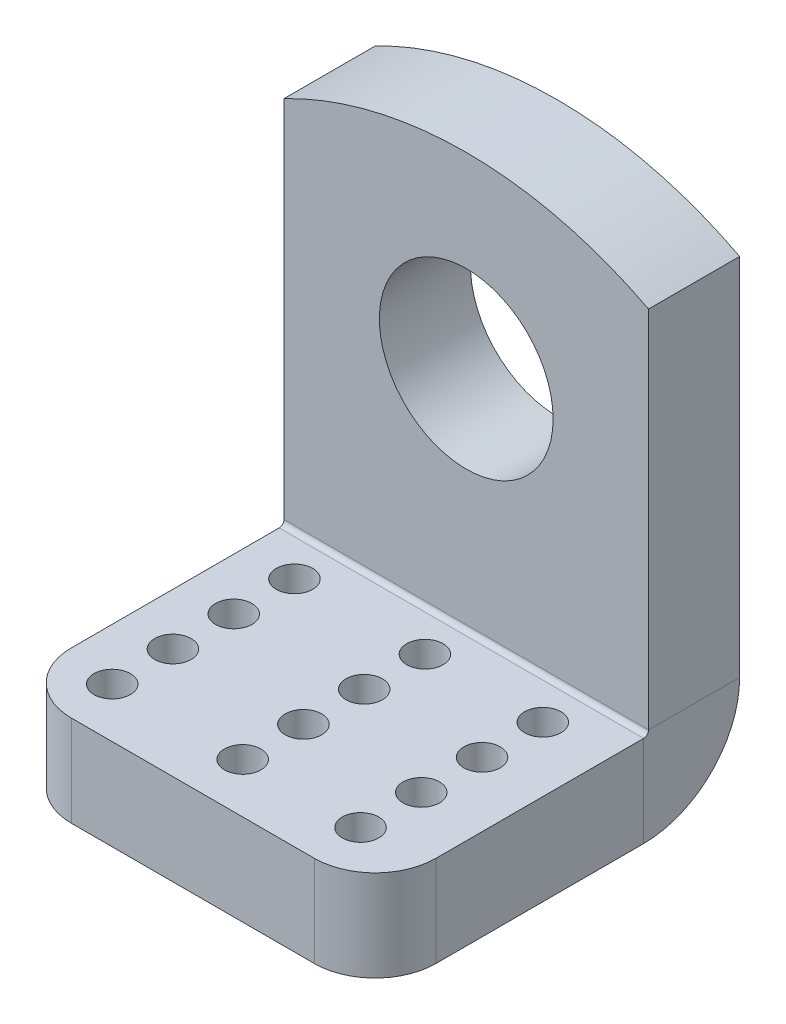
ISO-10303-21;
HEADER;
FILE_DESCRIPTION(('STEP AP214'),'2;1');
FILE_NAME('part.step','',(''),(''),'','','');
FILE_SCHEMA(('AUTOMOTIVE_DESIGN { 1 0 10303 214 1 1 1 1 }'));
ENDSEC;
DATA;
#1=APPLICATION_CONTEXT('core data for automotive mechanical design processes');
#2=APPLICATION_PROTOCOL_DEFINITION('international standard','automotive_design',2000,#1);
#3=PRODUCT_CONTEXT('',#1,'mechanical');
#4=PRODUCT('Part','Part','',(#3));
#5=PRODUCT_RELATED_PRODUCT_CATEGORY('part','',(#4));
#6=PRODUCT_DEFINITION_FORMATION('','',#4);
#7=PRODUCT_DEFINITION_CONTEXT('part definition',#1,'design');
#8=PRODUCT_DEFINITION('design','',#6,#7);
#9=PRODUCT_DEFINITION_SHAPE('','',#8);
#10=(LENGTH_UNIT() NAMED_UNIT(*) SI_UNIT(.MILLI.,.METRE.));
#11=(NAMED_UNIT(*) PLANE_ANGLE_UNIT() SI_UNIT($,.RADIAN.));
#12=(NAMED_UNIT(*) SI_UNIT($,.STERADIAN.) SOLID_ANGLE_UNIT());
#13=UNCERTAINTY_MEASURE_WITH_UNIT(LENGTH_MEASURE(1.E-05),#10,'distance_accuracy_value','');
#14=(GEOMETRIC_REPRESENTATION_CONTEXT(3) GLOBAL_UNCERTAINTY_ASSIGNED_CONTEXT((#13)) GLOBAL_UNIT_ASSIGNED_CONTEXT((#10,
#11,#12)) REPRESENTATION_CONTEXT('',''));
#15=CARTESIAN_POINT('',(0.,0.,0.));
#16=DIRECTION('',(0.,0.,1.));
#17=DIRECTION('',(1.,0.,0.));
#18=AXIS2_PLACEMENT_3D('',#15,#16,#17);
#19=CARTESIAN_POINT('',(-30.,0.,-15.));
#20=DIRECTION('',(-1.,0.,0.));
#21=DIRECTION('',(0.,0.,1.));
#22=AXIS2_PLACEMENT_3D('',#19,#20,#21);
#23=PLANE('',#22);
#24=DIRECTION('',(0.,-1.,0.));
#25=VECTOR('',#24,1.);
#26=CARTESIAN_POINT('',(-30.,0.,0.));
#27=LINE('',#26,#25);
#28=CARTESIAN_POINT('',(-30.,60.,0.));
#29=VERTEX_POINT('',#28);
#30=CARTESIAN_POINT('',(-30.,0.,0.));
#31=VERTEX_POINT('',#30);
#32=EDGE_CURVE('E194',#29,#31,#27,.T.);
#33=ORIENTED_EDGE('',*,*,#32,.F.);
#34=DIRECTION('',(0.,0.,1.));
#35=VECTOR('',#34,1.);
#36=CARTESIAN_POINT('',(-30.,60.,-15.));
#37=LINE('',#36,#35);
#38=CARTESIAN_POINT('',(-30.,60.,-15.));
#39=VERTEX_POINT('',#38);
#40=EDGE_CURVE('E219',#39,#29,#37,.T.);
#41=ORIENTED_EDGE('',*,*,#40,.F.);
#42=DIRECTION('',(0.,-1.,0.));
#43=VECTOR('',#42,1.);
#44=CARTESIAN_POINT('',(-30.,0.,-15.));
#45=LINE('',#44,#43);
#46=CARTESIAN_POINT('',(-30.,0.,-15.));
#47=VERTEX_POINT('',#46);
#48=EDGE_CURVE('E197',#39,#47,#45,.T.);
#49=ORIENTED_EDGE('',*,*,#48,.T.);
#50=DIRECTION('',(0.,0.,1.));
#51=VECTOR('',#50,1.);
#52=CARTESIAN_POINT('',(-30.,0.,-15.));
#53=LINE('',#52,#51);
#54=EDGE_CURVE('E208',#47,#31,#53,.T.);
#55=ORIENTED_EDGE('',*,*,#54,.T.);
#56=EDGE_LOOP('',(#33,#41,#49,#55));
#57=FACE_BOUND('',#56,.T.);
#58=ADVANCED_FACE('F59',(#57),#23,.T.);
#59=CARTESIAN_POINT('',(0.,2.33718702664602,-15.));
#60=DIRECTION('',(0.,0.,1.));
#61=DIRECTION('',(1.,0.,0.));
#62=AXIS2_PLACEMENT_3D('',#59,#60,#61);
#63=CYLINDRICAL_SURFACE('',#62,65.);
#64=CARTESIAN_POINT('',(0.,2.33718702664602,0.));
#65=DIRECTION('',(0.,0.,1.));
#66=DIRECTION('',(-1.,0.,0.));
#67=AXIS2_PLACEMENT_3D('',#64,#65,#66);
#68=CIRCLE('',#67,65.);
#69=CARTESIAN_POINT('',(30.,60.,0.));
#70=VERTEX_POINT('',#69);
#71=EDGE_CURVE('E200',#70,#29,#68,.T.);
#72=ORIENTED_EDGE('',*,*,#71,.F.);
#73=DIRECTION('',(0.,0.,1.));
#74=VECTOR('',#73,1.);
#75=CARTESIAN_POINT('',(30.,60.,-15.));
#76=LINE('',#75,#74);
#77=CARTESIAN_POINT('',(30.,60.,-15.));
#78=VERTEX_POINT('',#77);
#79=EDGE_CURVE('E222',#78,#70,#76,.T.);
#80=ORIENTED_EDGE('',*,*,#79,.F.);
#81=CARTESIAN_POINT('',(0.,2.33718702664602,-15.));
#82=DIRECTION('',(0.,0.,1.));
#83=DIRECTION('',(-1.,0.,0.));
#84=AXIS2_PLACEMENT_3D('',#81,#82,#83);
#85=CIRCLE('',#84,65.);
#86=EDGE_CURVE('E205',#78,#39,#85,.T.);
#87=ORIENTED_EDGE('',*,*,#86,.T.);
#88=ORIENTED_EDGE('',*,*,#40,.T.);
#89=EDGE_LOOP('',(#72,#80,#87,#88));
#90=FACE_BOUND('',#89,.T.);
#91=ADVANCED_FACE('F267',(#90),#63,.T.);
#92=CARTESIAN_POINT('',(30.,0.,-15.));
#93=DIRECTION('',(1.,0.,0.));
#94=DIRECTION('',(0.,0.,-1.));
#95=AXIS2_PLACEMENT_3D('',#92,#93,#94);
#96=PLANE('',#95);
#97=DIRECTION('',(0.,1.,0.));
#98=VECTOR('',#97,1.);
#99=CARTESIAN_POINT('',(30.,0.,0.));
#100=LINE('',#99,#98);
#101=CARTESIAN_POINT('',(30.,0.,0.));
#102=VERTEX_POINT('',#101);
#103=EDGE_CURVE('E214',#102,#70,#100,.T.);
#104=ORIENTED_EDGE('',*,*,#103,.F.);
#105=DIRECTION('',(0.,0.,1.));
#106=VECTOR('',#105,1.);
#107=CARTESIAN_POINT('',(30.,0.,-15.));
#108=LINE('',#107,#106);
#109=CARTESIAN_POINT('',(30.,0.,-15.));
#110=VERTEX_POINT('',#109);
#111=EDGE_CURVE('E224',#110,#102,#108,.T.);
#112=ORIENTED_EDGE('',*,*,#111,.F.);
#113=DIRECTION('',(0.,1.,0.));
#114=VECTOR('',#113,1.);
#115=CARTESIAN_POINT('',(30.,0.,-15.));
#116=LINE('',#115,#114);
#117=EDGE_CURVE('E202',#110,#78,#116,.T.);
#118=ORIENTED_EDGE('',*,*,#117,.T.);
#119=ORIENTED_EDGE('',*,*,#79,.T.);
#120=EDGE_LOOP('',(#104,#112,#118,#119));
#121=FACE_BOUND('',#120,.T.);
#122=ADVANCED_FACE('F273',(#121),#96,.T.);
#123=CARTESIAN_POINT('',(0.,2.33718702664602,-15.));
#124=DIRECTION('',(0.,0.,-1.));
#125=DIRECTION('',(-1.,0.,0.));
#126=AXIS2_PLACEMENT_3D('',#123,#124,#125);
#127=PLANE('',#126);
#128=CARTESIAN_POINT('',(0.,36.48,-15.));
#129=DIRECTION('',(0.,0.,1.));
#130=DIRECTION('',(1.,0.,0.));
#131=AXIS2_PLACEMENT_3D('',#128,#129,#130);
#132=CIRCLE('',#131,14.3);
#133=CARTESIAN_POINT('',(14.3,36.48,-15.));
#134=VERTEX_POINT('',#133);
#135=EDGE_CURVE('E191',#134,#134,#132,.T.);
#136=ORIENTED_EDGE('',*,*,#135,.T.);
#137=EDGE_LOOP('',(#136));
#138=FACE_BOUND('',#137,.T.);
#139=ORIENTED_EDGE('',*,*,#48,.F.);
#140=ORIENTED_EDGE('',*,*,#86,.F.);
#141=ORIENTED_EDGE('',*,*,#117,.F.);
#142=DIRECTION('',(1.,0.,0.));
#143=VECTOR('',#142,1.);
#144=CARTESIAN_POINT('',(-30.,0.,-15.));
#145=LINE('',#144,#143);
#146=EDGE_CURVE('E147',#47,#110,#145,.T.);
#147=ORIENTED_EDGE('',*,*,#146,.F.);
#148=EDGE_LOOP('',(#139,#140,#141,#147));
#149=FACE_BOUND('',#148,.T.);
#150=ADVANCED_FACE('F270',(#138,#149),#127,.T.);
#151=CARTESIAN_POINT('',(0.,2.33718702664602,0.));
#152=DIRECTION('',(0.,0.,-1.));
#153=DIRECTION('',(-1.,0.,0.));
#154=AXIS2_PLACEMENT_3D('',#151,#152,#153);
#155=PLANE('',#154);
#156=CARTESIAN_POINT('',(0.,36.48,0.));
#157=DIRECTION('',(0.,0.,1.));
#158=DIRECTION('',(1.,0.,0.));
#159=AXIS2_PLACEMENT_3D('',#156,#157,#158);
#160=CIRCLE('',#159,14.3);
#161=CARTESIAN_POINT('',(14.3,36.48,0.));
#162=VERTEX_POINT('',#161);
#163=EDGE_CURVE('E186',#162,#162,#160,.T.);
#164=ORIENTED_EDGE('',*,*,#163,.F.);
#165=EDGE_LOOP('',(#164));
#166=FACE_BOUND('',#165,.T.);
#167=ORIENTED_EDGE('',*,*,#32,.T.);
#168=DIRECTION('',(1.,0.,0.));
#169=VECTOR('',#168,1.);
#170=CARTESIAN_POINT('',(-30.,0.,0.));
#171=LINE('',#170,#169);
#172=EDGE_CURVE('E211',#31,#102,#171,.T.);
#173=ORIENTED_EDGE('',*,*,#172,.T.);
#174=ORIENTED_EDGE('',*,*,#103,.T.);
#175=ORIENTED_EDGE('',*,*,#71,.T.);
#176=EDGE_LOOP('',(#167,#173,#174,#175));
#177=FACE_BOUND('',#176,.T.);
#178=ADVANCED_FACE('F264',(#166,#177),#155,.F.);
#179=CARTESIAN_POINT('',(0.,36.48,-15.));
#180=DIRECTION('',(0.,0.,1.));
#181=DIRECTION('',(1.,0.,0.));
#182=AXIS2_PLACEMENT_3D('',#179,#180,#181);
#183=CYLINDRICAL_SURFACE('',#182,14.3);
#184=ORIENTED_EDGE('',*,*,#135,.F.);
#185=EDGE_LOOP('',(#184));
#186=FACE_BOUND('',#185,.T.);
#187=ORIENTED_EDGE('',*,*,#163,.T.);
#188=EDGE_LOOP('',(#187));
#189=FACE_BOUND('',#188,.T.);
#190=ADVANCED_FACE('F348',(#186,#189),#183,.F.);
#191=CARTESIAN_POINT('',(-30.,0.,0.8));
#192=DIRECTION('',(-1.,0.,0.));
#193=DIRECTION('',(0.,-1.,0.));
#194=AXIS2_PLACEMENT_3D('',#191,#192,#193);
#195=PLANE('',#194);
#196=DIRECTION('',(0.,1.,0.));
#197=VECTOR('',#196,1.);
#198=CARTESIAN_POINT('',(-30.,-15.8,0.799999999999945));
#199=LINE('',#198,#197);
#200=CARTESIAN_POINT('',(-30.,-0.8,0.799999999999997));
#201=VERTEX_POINT('',#200);
#202=CARTESIAN_POINT('',(-30.,-15.8,0.799999999999944));
#203=VERTEX_POINT('',#202);
#204=EDGE_CURVE('E182',#201,#203,#199,.F.);
#205=ORIENTED_EDGE('',*,*,#204,.F.);
#206=CARTESIAN_POINT('',(-30.,0.,0.8));
#207=DIRECTION('',(1.,0.,0.));
#208=DIRECTION('',(0.,1.,0.));
#209=AXIS2_PLACEMENT_3D('',#206,#207,#208);
#210=CIRCLE('',#209,0.799999999999998);
#211=EDGE_CURVE('E151',#31,#201,#210,.F.);
#212=ORIENTED_EDGE('',*,*,#211,.F.);
#213=ORIENTED_EDGE('',*,*,#54,.F.);
#214=CARTESIAN_POINT('',(-30.,0.,0.8));
#215=DIRECTION('',(1.,0.,0.));
#216=DIRECTION('',(0.,1.,0.));
#217=AXIS2_PLACEMENT_3D('',#214,#215,#216);
#218=CIRCLE('',#217,15.8);
#219=EDGE_CURVE('E150',#47,#203,#218,.F.);
#220=ORIENTED_EDGE('',*,*,#219,.T.);
#221=EDGE_LOOP('',(#205,#212,#213,#220));
#222=FACE_BOUND('',#221,.T.);
#223=ADVANCED_FACE('F259',(#222),#195,.T.);
#224=CARTESIAN_POINT('',(30.,0.,0.8));
#225=DIRECTION('',(-1.,0.,0.));
#226=DIRECTION('',(0.,-1.,0.));
#227=AXIS2_PLACEMENT_3D('',#224,#225,#226);
#228=PLANE('',#227);
#229=CARTESIAN_POINT('',(30.,0.,0.8));
#230=DIRECTION('',(1.,0.,0.));
#231=DIRECTION('',(0.,1.,0.));
#232=AXIS2_PLACEMENT_3D('',#229,#230,#231);
#233=CIRCLE('',#232,0.799999999999998);
#234=CARTESIAN_POINT('',(30.,-0.799999999999996,0.799999999999997));
#235=VERTEX_POINT('',#234);
#236=EDGE_CURVE('E158',#235,#102,#233,.T.);
#237=ORIENTED_EDGE('',*,*,#236,.F.);
#238=DIRECTION('',(0.,1.,0.));
#239=VECTOR('',#238,1.);
#240=CARTESIAN_POINT('',(30.,-0.8,0.799999999999997));
#241=LINE('',#240,#239);
#242=CARTESIAN_POINT('',(30.,-15.8,0.799999999999945));
#243=VERTEX_POINT('',#242);
#244=EDGE_CURVE('E155',#235,#243,#241,.F.);
#245=ORIENTED_EDGE('',*,*,#244,.T.);
#246=CARTESIAN_POINT('',(30.,0.,0.8));
#247=DIRECTION('',(1.,0.,0.));
#248=DIRECTION('',(0.,1.,0.));
#249=AXIS2_PLACEMENT_3D('',#246,#247,#248);
#250=CIRCLE('',#249,15.8);
#251=EDGE_CURVE('E140',#243,#110,#250,.T.);
#252=ORIENTED_EDGE('',*,*,#251,.T.);
#253=ORIENTED_EDGE('',*,*,#111,.T.);
#254=EDGE_LOOP('',(#237,#245,#252,#253));
#255=FACE_BOUND('',#254,.T.);
#256=ADVANCED_FACE('F156',(#255),#228,.F.);
#257=CARTESIAN_POINT('',(30.,0.,0.8));
#258=DIRECTION('',(1.,0.,0.));
#259=DIRECTION('',(0.,-1.,0.));
#260=AXIS2_PLACEMENT_3D('',#257,#258,#259);
#261=CYLINDRICAL_SURFACE('',#260,15.8);
#262=ORIENTED_EDGE('',*,*,#146,.T.);
#263=ORIENTED_EDGE('',*,*,#251,.F.);
#264=DIRECTION('',(1.,0.,0.));
#265=VECTOR('',#264,1.);
#266=CARTESIAN_POINT('',(-30.,-15.8,0.799999999999945));
#267=LINE('',#266,#265);
#268=EDGE_CURVE('E145',#243,#203,#267,.F.);
#269=ORIENTED_EDGE('',*,*,#268,.T.);
#270=ORIENTED_EDGE('',*,*,#219,.F.);
#271=EDGE_LOOP('',(#262,#263,#269,#270));
#272=FACE_BOUND('',#271,.T.);
#273=ADVANCED_FACE('F142',(#272),#261,.T.);
#274=CARTESIAN_POINT('',(30.,0.,0.8));
#275=DIRECTION('',(1.,0.,0.));
#276=DIRECTION('',(0.,-1.,0.));
#277=AXIS2_PLACEMENT_3D('',#274,#275,#276);
#278=CYLINDRICAL_SURFACE('',#277,0.799999999999998);
#279=ORIENTED_EDGE('',*,*,#172,.F.);
#280=ORIENTED_EDGE('',*,*,#211,.T.);
#281=DIRECTION('',(1.,0.,0.));
#282=VECTOR('',#281,1.);
#283=CARTESIAN_POINT('',(-30.,-0.8,0.799999999999997));
#284=LINE('',#283,#282);
#285=EDGE_CURVE('E160',#201,#235,#284,.T.);
#286=ORIENTED_EDGE('',*,*,#285,.T.);
#287=ORIENTED_EDGE('',*,*,#236,.T.);
#288=EDGE_LOOP('',(#279,#280,#286,#287));
#289=FACE_BOUND('',#288,.T.);
#290=ADVANCED_FACE('F255',(#289),#278,.F.);
#291=CARTESIAN_POINT('',(-30.,-15.8,0.));
#292=DIRECTION('',(1.,0.,0.));
#293=DIRECTION('',(0.,0.,-1.));
#294=AXIS2_PLACEMENT_3D('',#291,#292,#293);
#295=PLANE('',#294);
#296=DIRECTION('',(0.,0.,-1.));
#297=VECTOR('',#296,1.);
#298=CARTESIAN_POINT('',(-30.,-15.8,0.));
#299=LINE('',#298,#297);
#300=CARTESIAN_POINT('',(-30.,-15.8000000000001,35.));
#301=VERTEX_POINT('',#300);
#302=EDGE_CURVE('E165',#301,#203,#299,.T.);
#303=ORIENTED_EDGE('',*,*,#302,.F.);
#304=DIRECTION('',(0.,1.,0.));
#305=VECTOR('',#304,1.);
#306=CARTESIAN_POINT('',(-30.,-15.8000000000001,35.));
#307=LINE('',#306,#305);
#308=CARTESIAN_POINT('',(-30.,-0.800000000000119,35.0000000000001));
#309=VERTEX_POINT('',#308);
#310=EDGE_CURVE('E13',#301,#309,#307,.T.);
#311=ORIENTED_EDGE('',*,*,#310,.T.);
#312=DIRECTION('',(0.,0.,1.));
#313=VECTOR('',#312,1.);
#314=CARTESIAN_POINT('',(-30.,-0.799999999999997,0.));
#315=LINE('',#314,#313);
#316=EDGE_CURVE('E166',#309,#201,#315,.F.);
#317=ORIENTED_EDGE('',*,*,#316,.T.);
#318=ORIENTED_EDGE('',*,*,#204,.T.);
#319=EDGE_LOOP('',(#303,#311,#317,#318));
#320=FACE_BOUND('',#319,.T.);
#321=ADVANCED_FACE('F251',(#320),#295,.F.);
#322=CARTESIAN_POINT('',(30.,-15.8000000000002,45.));
#323=DIRECTION('',(-1.,0.,0.));
#324=DIRECTION('',(0.,0.,1.));
#325=AXIS2_PLACEMENT_3D('',#322,#323,#324);
#326=PLANE('',#325);
#327=DIRECTION('',(0.,0.,-1.));
#328=VECTOR('',#327,1.);
#329=CARTESIAN_POINT('',(30.,-0.800000000000155,45.0000000000001));
#330=LINE('',#329,#328);
#331=CARTESIAN_POINT('',(30.,-0.80000000000012,35.0000000000001));
#332=VERTEX_POINT('',#331);
#333=EDGE_CURVE('E178',#235,#332,#330,.F.);
#334=ORIENTED_EDGE('',*,*,#333,.T.);
#335=DIRECTION('',(0.,1.,0.));
#336=VECTOR('',#335,1.);
#337=CARTESIAN_POINT('',(30.,-15.8000000000001,35.));
#338=LINE('',#337,#336);
#339=CARTESIAN_POINT('',(30.,-15.8000000000001,35.));
#340=VERTEX_POINT('',#339);
#341=EDGE_CURVE('E82',#332,#340,#338,.F.);
#342=ORIENTED_EDGE('',*,*,#341,.T.);
#343=DIRECTION('',(0.,0.,1.));
#344=VECTOR('',#343,1.);
#345=CARTESIAN_POINT('',(30.,-15.8,0.));
#346=LINE('',#345,#344);
#347=EDGE_CURVE('E163',#243,#340,#346,.T.);
#348=ORIENTED_EDGE('',*,*,#347,.F.);
#349=ORIENTED_EDGE('',*,*,#244,.F.);
#350=EDGE_LOOP('',(#334,#342,#348,#349));
#351=FACE_BOUND('',#350,.T.);
#352=ADVANCED_FACE('F168',(#351),#326,.F.);
#353=CARTESIAN_POINT('',(0.,-15.8,0.));
#354=DIRECTION('',(0.,1.,0.));
#355=DIRECTION('',(0.,0.,1.));
#356=AXIS2_PLACEMENT_3D('',#353,#354,#355);
#357=PLANE('',#356);
#358=CARTESIAN_POINT('',(-21.4780939505529,-15.8000000000001,36.8007276352638));
#359=DIRECTION('',(0.,1.,0.));
#360=DIRECTION('',(0.,0.,1.));
#361=AXIS2_PLACEMENT_3D('',#358,#359,#360);
#362=CIRCLE('',#361,3.);
#363=CARTESIAN_POINT('',(-21.4780939505529,-15.8000000000001,39.8007276352638));
#364=VERTEX_POINT('',#363);
#365=EDGE_CURVE('E185',#364,#364,#362,.T.);
#366=ORIENTED_EDGE('',*,*,#365,.T.);
#367=EDGE_LOOP('',(#366));
#368=FACE_BOUND('',#367,.T.);
#369=CARTESIAN_POINT('',(1.05479317354402E-13,-15.8000000000001,16.8007276352638));
#370=DIRECTION('',(0.,1.,0.));
#371=DIRECTION('',(0.,0.,1.));
#372=AXIS2_PLACEMENT_3D('',#369,#370,#371);
#373=CIRCLE('',#372,3.);
#374=CARTESIAN_POINT('',(1.05479317354402E-13,-15.8000000000001,19.8007276352638));
#375=VERTEX_POINT('',#374);
#376=EDGE_CURVE('E522',#375,#375,#373,.T.);
#377=ORIENTED_EDGE('',*,*,#376,.T.);
#378=EDGE_LOOP('',(#377));
#379=FACE_BOUND('',#378,.T.);
#380=CARTESIAN_POINT('',(2.10223757519696E-13,-15.8000000000001,26.8007276352638));
#381=DIRECTION('',(0.,1.,0.));
#382=DIRECTION('',(0.,0.,1.));
#383=AXIS2_PLACEMENT_3D('',#380,#381,#382);
#384=CIRCLE('',#383,3.);
#385=CARTESIAN_POINT('',(2.10223757519696E-13,-15.8000000000001,29.8007276352638));
#386=VERTEX_POINT('',#385);
#387=EDGE_CURVE('E520',#386,#386,#384,.T.);
#388=ORIENTED_EDGE('',*,*,#387,.T.);
#389=EDGE_LOOP('',(#388));
#390=FACE_BOUND('',#389,.T.);
#391=CARTESIAN_POINT('',(3.1496819768499E-13,-15.8000000000001,36.8007276352638));
#392=DIRECTION('',(0.,1.,0.));
#393=DIRECTION('',(0.,0.,1.));
#394=AXIS2_PLACEMENT_3D('',#391,#392,#393);
#395=CIRCLE('',#394,3.);
#396=CARTESIAN_POINT('',(3.1496819768499E-13,-15.8000000000001,39.8007276352638));
#397=VERTEX_POINT('',#396);
#398=EDGE_CURVE('E523',#397,#397,#395,.T.);
#399=ORIENTED_EDGE('',*,*,#398,.T.);
#400=EDGE_LOOP('',(#399));
#401=FACE_BOUND('',#400,.T.);
#402=CARTESIAN_POINT('',(-21.478093950553,-15.8000000000001,26.8007276352638));
#403=DIRECTION('',(0.,1.,0.));
#404=DIRECTION('',(0.,0.,1.));
#405=AXIS2_PLACEMENT_3D('',#402,#403,#404);
#406=CIRCLE('',#405,3.);
#407=CARTESIAN_POINT('',(-21.478093950553,-15.8000000000001,29.8007276352638));
#408=VERTEX_POINT('',#407);
#409=EDGE_CURVE('E528',#408,#408,#406,.T.);
#410=ORIENTED_EDGE('',*,*,#409,.T.);
#411=EDGE_LOOP('',(#410));
#412=FACE_BOUND('',#411,.T.);
#413=CARTESIAN_POINT('',(-21.4780939505531,-15.8000000000001,16.8007276352638));
#414=DIRECTION('',(0.,1.,0.));
#415=DIRECTION('',(0.,0.,1.));
#416=AXIS2_PLACEMENT_3D('',#413,#414,#415);
#417=CIRCLE('',#416,3.);
#418=CARTESIAN_POINT('',(-21.4780939505531,-15.8000000000001,19.8007276352638));
#419=VERTEX_POINT('',#418);
#420=EDGE_CURVE('E544',#419,#419,#417,.T.);
#421=ORIENTED_EDGE('',*,*,#420,.T.);
#422=EDGE_LOOP('',(#421));
#423=FACE_BOUND('',#422,.T.);
#424=CARTESIAN_POINT('',(0.,-15.8,6.80072763526384));
#425=DIRECTION('',(0.,1.,0.));
#426=DIRECTION('',(0.,0.,1.));
#427=AXIS2_PLACEMENT_3D('',#424,#425,#426);
#428=CIRCLE('',#427,3.);
#429=CARTESIAN_POINT('',(0.,-15.8,9.80072763526384));
#430=VERTEX_POINT('',#429);
#431=EDGE_CURVE('E548',#430,#430,#428,.T.);
#432=ORIENTED_EDGE('',*,*,#431,.T.);
#433=EDGE_LOOP('',(#432));
#434=FACE_BOUND('',#433,.T.);
#435=CARTESIAN_POINT('',(19.3982785214493,-15.8,6.80072763526384));
#436=DIRECTION('',(0.,1.,0.));
#437=DIRECTION('',(0.,0.,1.));
#438=AXIS2_PLACEMENT_3D('',#435,#436,#437);
#439=CIRCLE('',#438,3.);
#440=CARTESIAN_POINT('',(19.3982785214493,-15.8,9.80072763526384));
#441=VERTEX_POINT('',#440);
#442=EDGE_CURVE('E552',#441,#441,#439,.T.);
#443=ORIENTED_EDGE('',*,*,#442,.T.);
#444=EDGE_LOOP('',(#443));
#445=FACE_BOUND('',#444,.T.);
#446=CARTESIAN_POINT('',(19.3982785214494,-15.8000000000001,16.8007276352638));
#447=DIRECTION('',(0.,1.,0.));
#448=DIRECTION('',(0.,0.,1.));
#449=AXIS2_PLACEMENT_3D('',#446,#447,#448);
#450=CIRCLE('',#449,3.);
#451=CARTESIAN_POINT('',(19.3982785214494,-15.8000000000001,19.8007276352638));
#452=VERTEX_POINT('',#451);
#453=EDGE_CURVE('E556',#452,#452,#450,.T.);
#454=ORIENTED_EDGE('',*,*,#453,.T.);
#455=EDGE_LOOP('',(#454));
#456=FACE_BOUND('',#455,.T.);
#457=CARTESIAN_POINT('',(19.3982785214495,-15.8000000000001,26.8007276352638));
#458=DIRECTION('',(0.,1.,0.));
#459=DIRECTION('',(0.,0.,1.));
#460=AXIS2_PLACEMENT_3D('',#457,#458,#459);
#461=CIRCLE('',#460,3.);
#462=CARTESIAN_POINT('',(19.3982785214495,-15.8000000000001,29.8007276352638));
#463=VERTEX_POINT('',#462);
#464=EDGE_CURVE('E560',#463,#463,#461,.T.);
#465=ORIENTED_EDGE('',*,*,#464,.T.);
#466=EDGE_LOOP('',(#465));
#467=FACE_BOUND('',#466,.T.);
#468=CARTESIAN_POINT('',(19.3982785214496,-15.8000000000001,36.8007276352638));
#469=DIRECTION('',(0.,1.,0.));
#470=DIRECTION('',(0.,0.,1.));
#471=AXIS2_PLACEMENT_3D('',#468,#469,#470);
#472=CIRCLE('',#471,3.);
#473=CARTESIAN_POINT('',(19.3982785214496,-15.8000000000001,39.8007276352638));
#474=VERTEX_POINT('',#473);
#475=EDGE_CURVE('E564',#474,#474,#472,.T.);
#476=ORIENTED_EDGE('',*,*,#475,.T.);
#477=EDGE_LOOP('',(#476));
#478=FACE_BOUND('',#477,.T.);
#479=CARTESIAN_POINT('',(-21.4780939505532,-15.8,6.80072763526384));
#480=DIRECTION('',(0.,1.,0.));
#481=DIRECTION('',(0.,0.,1.));
#482=AXIS2_PLACEMENT_3D('',#479,#480,#481);
#483=CIRCLE('',#482,3.);
#484=CARTESIAN_POINT('',(-21.4780939505532,-15.8,9.80072763526384));
#485=VERTEX_POINT('',#484);
#486=EDGE_CURVE('E567',#485,#485,#483,.T.);
#487=ORIENTED_EDGE('',*,*,#486,.T.);
#488=EDGE_LOOP('',(#487));
#489=FACE_BOUND('',#488,.T.);
#490=ORIENTED_EDGE('',*,*,#347,.T.);
#491=CARTESIAN_POINT('',(20.,-15.8000000000001,35.));
#492=DIRECTION('',(0.,1.,0.));
#493=DIRECTION('',(0.,0.,1.));
#494=AXIS2_PLACEMENT_3D('',#491,#492,#493);
#495=CIRCLE('',#494,10.);
#496=CARTESIAN_POINT('',(20.,-15.8000000000002,45.));
#497=VERTEX_POINT('',#496);
#498=EDGE_CURVE('E67',#340,#497,#495,.F.);
#499=ORIENTED_EDGE('',*,*,#498,.T.);
#500=DIRECTION('',(-1.,0.,0.));
#501=VECTOR('',#500,1.);
#502=CARTESIAN_POINT('',(0.,-15.8000000000002,45.));
#503=LINE('',#502,#501);
#504=CARTESIAN_POINT('',(-20.,-15.8000000000002,45.));
#505=VERTEX_POINT('',#504);
#506=EDGE_CURVE('E169',#497,#505,#503,.T.);
#507=ORIENTED_EDGE('',*,*,#506,.T.);
#508=CARTESIAN_POINT('',(-20.,-15.8000000000001,35.));
#509=DIRECTION('',(0.,1.,0.));
#510=DIRECTION('',(0.,0.,1.));
#511=AXIS2_PLACEMENT_3D('',#508,#509,#510);
#512=CIRCLE('',#511,10.);
#513=EDGE_CURVE('E74',#505,#301,#512,.F.);
#514=ORIENTED_EDGE('',*,*,#513,.T.);
#515=ORIENTED_EDGE('',*,*,#302,.T.);
#516=ORIENTED_EDGE('',*,*,#268,.F.);
#517=EDGE_LOOP('',(#490,#499,#507,#514,#515,#516));
#518=FACE_BOUND('',#517,.T.);
#519=ADVANCED_FACE('F162',(#368,#379,#390,#401,#412,#423,#434,#445,#456,#467,#478,#489,#518),
#357,.F.);
#520=CARTESIAN_POINT('',(0.,-0.799999999999997,0.));
#521=DIRECTION('',(0.,1.,0.));
#522=DIRECTION('',(0.,0.,1.));
#523=AXIS2_PLACEMENT_3D('',#520,#521,#522);
#524=PLANE('',#523);
#525=CARTESIAN_POINT('',(-21.4780939505529,-0.800000000000126,36.8007276352639));
#526=DIRECTION('',(0.,1.,0.));
#527=DIRECTION('',(0.,0.,1.));
#528=AXIS2_PLACEMENT_3D('',#525,#526,#527);
#529=CIRCLE('',#528,3.);
#530=CARTESIAN_POINT('',(-21.4780939505529,-0.800000000000136,39.8007276352639));
#531=VERTEX_POINT('',#530);
#532=EDGE_CURVE('E585',#531,#531,#529,.T.);
#533=ORIENTED_EDGE('',*,*,#532,.F.);
#534=EDGE_LOOP('',(#533));
#535=FACE_BOUND('',#534,.T.);
#536=CARTESIAN_POINT('',(1.05479317354402E-13,-0.800000000000056,16.8007276352639));
#537=DIRECTION('',(0.,1.,0.));
#538=DIRECTION('',(0.,0.,1.));
#539=AXIS2_PLACEMENT_3D('',#536,#537,#538);
#540=CIRCLE('',#539,3.);
#541=CARTESIAN_POINT('',(1.05479317354402E-13,-0.800000000000066,19.8007276352639));
#542=VERTEX_POINT('',#541);
#543=EDGE_CURVE('E593',#542,#542,#540,.T.);
#544=ORIENTED_EDGE('',*,*,#543,.F.);
#545=EDGE_LOOP('',(#544));
#546=FACE_BOUND('',#545,.T.);
#547=CARTESIAN_POINT('',(2.10223757519696E-13,-0.800000000000091,26.8007276352639));
#548=DIRECTION('',(0.,1.,0.));
#549=DIRECTION('',(0.,0.,1.));
#550=AXIS2_PLACEMENT_3D('',#547,#548,#549);
#551=CIRCLE('',#550,3.);
#552=CARTESIAN_POINT('',(2.10223757519696E-13,-0.800000000000101,29.8007276352639));
#553=VERTEX_POINT('',#552);
#554=EDGE_CURVE('E517',#553,#553,#551,.T.);
#555=ORIENTED_EDGE('',*,*,#554,.F.);
#556=EDGE_LOOP('',(#555));
#557=FACE_BOUND('',#556,.T.);
#558=CARTESIAN_POINT('',(3.1496819768499E-13,-0.800000000000126,36.8007276352639));
#559=DIRECTION('',(0.,1.,0.));
#560=DIRECTION('',(0.,0.,1.));
#561=AXIS2_PLACEMENT_3D('',#558,#559,#560);
#562=CIRCLE('',#561,3.);
#563=CARTESIAN_POINT('',(3.1496819768499E-13,-0.800000000000136,39.8007276352639));
#564=VERTEX_POINT('',#563);
#565=EDGE_CURVE('E597',#564,#564,#562,.T.);
#566=ORIENTED_EDGE('',*,*,#565,.F.);
#567=EDGE_LOOP('',(#566));
#568=FACE_BOUND('',#567,.T.);
#569=CARTESIAN_POINT('',(-21.478093950553,-0.800000000000091,26.8007276352639));
#570=DIRECTION('',(0.,1.,0.));
#571=DIRECTION('',(0.,0.,1.));
#572=AXIS2_PLACEMENT_3D('',#569,#570,#571);
#573=CIRCLE('',#572,3.);
#574=CARTESIAN_POINT('',(-21.478093950553,-0.800000000000101,29.8007276352639));
#575=VERTEX_POINT('',#574);
#576=EDGE_CURVE('E581',#575,#575,#573,.T.);
#577=ORIENTED_EDGE('',*,*,#576,.F.);
#578=EDGE_LOOP('',(#577));
#579=FACE_BOUND('',#578,.T.);
#580=CARTESIAN_POINT('',(-21.4780939505531,-0.800000000000056,16.8007276352639));
#581=DIRECTION('',(0.,1.,0.));
#582=DIRECTION('',(0.,0.,1.));
#583=AXIS2_PLACEMENT_3D('',#580,#581,#582);
#584=CIRCLE('',#583,3.);
#585=CARTESIAN_POINT('',(-21.4780939505531,-0.800000000000066,19.8007276352639));
#586=VERTEX_POINT('',#585);
#587=EDGE_CURVE('E584',#586,#586,#584,.T.);
#588=ORIENTED_EDGE('',*,*,#587,.F.);
#589=EDGE_LOOP('',(#588));
#590=FACE_BOUND('',#589,.T.);
#591=CARTESIAN_POINT('',(0.,-0.800000000000021,6.8007276352639));
#592=DIRECTION('',(0.,1.,0.));
#593=DIRECTION('',(0.,0.,1.));
#594=AXIS2_PLACEMENT_3D('',#591,#592,#593);
#595=CIRCLE('',#594,3.);
#596=CARTESIAN_POINT('',(0.,-0.800000000000031,9.8007276352639));
#597=VERTEX_POINT('',#596);
#598=EDGE_CURVE('E588',#597,#597,#595,.T.);
#599=ORIENTED_EDGE('',*,*,#598,.F.);
#600=EDGE_LOOP('',(#599));
#601=FACE_BOUND('',#600,.T.);
#602=CARTESIAN_POINT('',(19.3982785214493,-0.800000000000021,6.8007276352639));
#603=DIRECTION('',(0.,1.,0.));
#604=DIRECTION('',(0.,0.,1.));
#605=AXIS2_PLACEMENT_3D('',#602,#603,#604);
#606=CIRCLE('',#605,3.);
#607=CARTESIAN_POINT('',(19.3982785214493,-0.800000000000031,9.8007276352639));
#608=VERTEX_POINT('',#607);
#609=EDGE_CURVE('E573',#608,#608,#606,.T.);
#610=ORIENTED_EDGE('',*,*,#609,.F.);
#611=EDGE_LOOP('',(#610));
#612=FACE_BOUND('',#611,.T.);
#613=CARTESIAN_POINT('',(19.3982785214494,-0.800000000000056,16.8007276352639));
#614=DIRECTION('',(0.,1.,0.));
#615=DIRECTION('',(0.,0.,1.));
#616=AXIS2_PLACEMENT_3D('',#613,#614,#615);
#617=CIRCLE('',#616,3.);
#618=CARTESIAN_POINT('',(19.3982785214494,-0.800000000000066,19.8007276352639));
#619=VERTEX_POINT('',#618);
#620=EDGE_CURVE('E600',#619,#619,#617,.T.);
#621=ORIENTED_EDGE('',*,*,#620,.F.);
#622=EDGE_LOOP('',(#621));
#623=FACE_BOUND('',#622,.T.);
#624=CARTESIAN_POINT('',(19.3982785214495,-0.800000000000091,26.8007276352639));
#625=DIRECTION('',(0.,1.,0.));
#626=DIRECTION('',(0.,0.,1.));
#627=AXIS2_PLACEMENT_3D('',#624,#625,#626);
#628=CIRCLE('',#627,3.);
#629=CARTESIAN_POINT('',(19.3982785214495,-0.800000000000101,29.8007276352639));
#630=VERTEX_POINT('',#629);
#631=EDGE_CURVE('E605',#630,#630,#628,.T.);
#632=ORIENTED_EDGE('',*,*,#631,.F.);
#633=EDGE_LOOP('',(#632));
#634=FACE_BOUND('',#633,.T.);
#635=CARTESIAN_POINT('',(19.3982785214496,-0.800000000000126,36.8007276352639));
#636=DIRECTION('',(0.,1.,0.));
#637=DIRECTION('',(0.,0.,1.));
#638=AXIS2_PLACEMENT_3D('',#635,#636,#637);
#639=CIRCLE('',#638,3.);
#640=CARTESIAN_POINT('',(19.3982785214496,-0.800000000000136,39.8007276352639));
#641=VERTEX_POINT('',#640);
#642=EDGE_CURVE('E602',#641,#641,#639,.T.);
#643=ORIENTED_EDGE('',*,*,#642,.F.);
#644=EDGE_LOOP('',(#643));
#645=FACE_BOUND('',#644,.T.);
#646=CARTESIAN_POINT('',(-21.4780939505532,-0.800000000000021,6.8007276352639));
#647=DIRECTION('',(0.,1.,0.));
#648=DIRECTION('',(0.,0.,1.));
#649=AXIS2_PLACEMENT_3D('',#646,#647,#648);
#650=CIRCLE('',#649,3.);
#651=CARTESIAN_POINT('',(-21.4780939505532,-0.800000000000031,9.8007276352639));
#652=VERTEX_POINT('',#651);
#653=EDGE_CURVE('E569',#652,#652,#650,.T.);
#654=ORIENTED_EDGE('',*,*,#653,.F.);
#655=EDGE_LOOP('',(#654));
#656=FACE_BOUND('',#655,.T.);
#657=DIRECTION('',(1.,0.,0.));
#658=VECTOR('',#657,1.);
#659=CARTESIAN_POINT('',(-30.,-0.800000000000155,45.0000000000001));
#660=LINE('',#659,#658);
#661=CARTESIAN_POINT('',(20.,-0.800000000000155,45.0000000000001));
#662=VERTEX_POINT('',#661);
#663=CARTESIAN_POINT('',(-20.,-0.800000000000155,45.0000000000001));
#664=VERTEX_POINT('',#663);
#665=EDGE_CURVE('E172',#662,#664,#660,.F.);
#666=ORIENTED_EDGE('',*,*,#665,.F.);
#667=CARTESIAN_POINT('',(20.,-0.800000000000118,35.0000000000001));
#668=DIRECTION('',(0.,1.,0.));
#669=DIRECTION('',(0.,0.,1.));
#670=AXIS2_PLACEMENT_3D('',#667,#668,#669);
#671=CIRCLE('',#670,10.);
#672=EDGE_CURVE('E233',#662,#332,#671,.T.);
#673=ORIENTED_EDGE('',*,*,#672,.T.);
#674=ORIENTED_EDGE('',*,*,#333,.F.);
#675=ORIENTED_EDGE('',*,*,#285,.F.);
#676=ORIENTED_EDGE('',*,*,#316,.F.);
#677=CARTESIAN_POINT('',(-20.,-0.800000000000118,35.0000000000001));
#678=DIRECTION('',(0.,1.,0.));
#679=DIRECTION('',(0.,0.,1.));
#680=AXIS2_PLACEMENT_3D('',#677,#678,#679);
#681=CIRCLE('',#680,10.);
#682=EDGE_CURVE('E231',#309,#664,#681,.T.);
#683=ORIENTED_EDGE('',*,*,#682,.T.);
#684=EDGE_LOOP('',(#666,#673,#674,#675,#676,#683));
#685=FACE_BOUND('',#684,.T.);
#686=ADVANCED_FACE('F245',(#535,#546,#557,#568,#579,#590,#601,#612,#623,#634,#645,#656,#685),
#524,.T.);
#687=CARTESIAN_POINT('',(-30.,-15.8000000000002,45.));
#688=DIRECTION('',(0.,0.,-1.));
#689=DIRECTION('',(0.,1.,0.));
#690=AXIS2_PLACEMENT_3D('',#687,#688,#689);
#691=PLANE('',#690);
#692=ORIENTED_EDGE('',*,*,#506,.F.);
#693=DIRECTION('',(0.,1.,0.));
#694=VECTOR('',#693,1.);
#695=CARTESIAN_POINT('',(20.,-15.8000000000002,45.));
#696=LINE('',#695,#694);
#697=EDGE_CURVE('E228',#497,#662,#696,.T.);
#698=ORIENTED_EDGE('',*,*,#697,.T.);
#699=ORIENTED_EDGE('',*,*,#665,.T.);
#700=DIRECTION('',(0.,1.,0.));
#701=VECTOR('',#700,1.);
#702=CARTESIAN_POINT('',(-20.,-15.8000000000002,45.));
#703=LINE('',#702,#701);
#704=EDGE_CURVE('E221',#664,#505,#703,.F.);
#705=ORIENTED_EDGE('',*,*,#704,.T.);
#706=EDGE_LOOP('',(#692,#698,#699,#705));
#707=FACE_BOUND('',#706,.T.);
#708=ADVANCED_FACE('F240',(#707),#691,.F.);
#709=CARTESIAN_POINT('',(-21.4780939505532,-50.8,6.80072763526372));
#710=DIRECTION('',(0.,1.,0.));
#711=DIRECTION('',(0.,0.,1.));
#712=AXIS2_PLACEMENT_3D('',#709,#710,#711);
#713=CYLINDRICAL_SURFACE('',#712,3.);
#714=ORIENTED_EDGE('',*,*,#653,.T.);
#715=EDGE_LOOP('',(#714));
#716=FACE_BOUND('',#715,.T.);
#717=ORIENTED_EDGE('',*,*,#486,.F.);
#718=EDGE_LOOP('',(#717));
#719=FACE_BOUND('',#718,.T.);
#720=ADVANCED_FACE('F325',(#716,#719),#713,.F.);
#721=CARTESIAN_POINT('',(19.3982785214496,-50.8000000000001,36.8007276352637));
#722=DIRECTION('',(0.,1.,0.));
#723=DIRECTION('',(0.,0.,1.));
#724=AXIS2_PLACEMENT_3D('',#721,#722,#723);
#725=CYLINDRICAL_SURFACE('',#724,3.);
#726=ORIENTED_EDGE('',*,*,#642,.T.);
#727=EDGE_LOOP('',(#726));
#728=FACE_BOUND('',#727,.T.);
#729=ORIENTED_EDGE('',*,*,#475,.F.);
#730=EDGE_LOOP('',(#729));
#731=FACE_BOUND('',#730,.T.);
#732=ADVANCED_FACE('F328',(#728,#731),#725,.F.);
#733=CARTESIAN_POINT('',(19.3982785214495,-50.8000000000001,26.8007276352637));
#734=DIRECTION('',(0.,1.,0.));
#735=DIRECTION('',(0.,0.,1.));
#736=AXIS2_PLACEMENT_3D('',#733,#734,#735);
#737=CYLINDRICAL_SURFACE('',#736,3.);
#738=ORIENTED_EDGE('',*,*,#631,.T.);
#739=EDGE_LOOP('',(#738));
#740=FACE_BOUND('',#739,.T.);
#741=ORIENTED_EDGE('',*,*,#464,.F.);
#742=EDGE_LOOP('',(#741));
#743=FACE_BOUND('',#742,.T.);
#744=ADVANCED_FACE('F428',(#740,#743),#737,.F.);
#745=CARTESIAN_POINT('',(19.3982785214494,-50.8000000000001,16.8007276352637));
#746=DIRECTION('',(0.,1.,0.));
#747=DIRECTION('',(0.,0.,1.));
#748=AXIS2_PLACEMENT_3D('',#745,#746,#747);
#749=CYLINDRICAL_SURFACE('',#748,3.);
#750=ORIENTED_EDGE('',*,*,#620,.T.);
#751=EDGE_LOOP('',(#750));
#752=FACE_BOUND('',#751,.T.);
#753=ORIENTED_EDGE('',*,*,#453,.F.);
#754=EDGE_LOOP('',(#753));
#755=FACE_BOUND('',#754,.T.);
#756=ADVANCED_FACE('F312',(#752,#755),#749,.F.);
#757=CARTESIAN_POINT('',(19.3982785214493,-50.8,6.80072763526372));
#758=DIRECTION('',(0.,1.,0.));
#759=DIRECTION('',(0.,0.,1.));
#760=AXIS2_PLACEMENT_3D('',#757,#758,#759);
#761=CYLINDRICAL_SURFACE('',#760,3.);
#762=ORIENTED_EDGE('',*,*,#609,.T.);
#763=EDGE_LOOP('',(#762));
#764=FACE_BOUND('',#763,.T.);
#765=ORIENTED_EDGE('',*,*,#442,.F.);
#766=EDGE_LOOP('',(#765));
#767=FACE_BOUND('',#766,.T.);
#768=ADVANCED_FACE('F308',(#764,#767),#761,.F.);
#769=CARTESIAN_POINT('',(0.,-50.8,6.80072763526372));
#770=DIRECTION('',(0.,1.,0.));
#771=DIRECTION('',(0.,0.,1.));
#772=AXIS2_PLACEMENT_3D('',#769,#770,#771);
#773=CYLINDRICAL_SURFACE('',#772,3.);
#774=ORIENTED_EDGE('',*,*,#598,.T.);
#775=EDGE_LOOP('',(#774));
#776=FACE_BOUND('',#775,.T.);
#777=ORIENTED_EDGE('',*,*,#431,.F.);
#778=EDGE_LOOP('',(#777));
#779=FACE_BOUND('',#778,.T.);
#780=ADVANCED_FACE('F311',(#776,#779),#773,.F.);
#781=CARTESIAN_POINT('',(-21.4780939505531,-50.8000000000001,16.8007276352637));
#782=DIRECTION('',(0.,1.,0.));
#783=DIRECTION('',(0.,0.,1.));
#784=AXIS2_PLACEMENT_3D('',#781,#782,#783);
#785=CYLINDRICAL_SURFACE('',#784,3.);
#786=ORIENTED_EDGE('',*,*,#587,.T.);
#787=EDGE_LOOP('',(#786));
#788=FACE_BOUND('',#787,.T.);
#789=ORIENTED_EDGE('',*,*,#420,.F.);
#790=EDGE_LOOP('',(#789));
#791=FACE_BOUND('',#790,.T.);
#792=ADVANCED_FACE('F316',(#788,#791),#785,.F.);
#793=CARTESIAN_POINT('',(-21.478093950553,-50.8000000000001,26.8007276352637));
#794=DIRECTION('',(0.,1.,0.));
#795=DIRECTION('',(0.,0.,1.));
#796=AXIS2_PLACEMENT_3D('',#793,#794,#795);
#797=CYLINDRICAL_SURFACE('',#796,3.);
#798=ORIENTED_EDGE('',*,*,#576,.T.);
#799=EDGE_LOOP('',(#798));
#800=FACE_BOUND('',#799,.T.);
#801=ORIENTED_EDGE('',*,*,#409,.F.);
#802=EDGE_LOOP('',(#801));
#803=FACE_BOUND('',#802,.T.);
#804=ADVANCED_FACE('F320',(#800,#803),#797,.F.);
#805=CARTESIAN_POINT('',(3.1496819768499E-13,-50.8000000000001,36.8007276352637));
#806=DIRECTION('',(0.,1.,0.));
#807=DIRECTION('',(0.,0.,1.));
#808=AXIS2_PLACEMENT_3D('',#805,#806,#807);
#809=CYLINDRICAL_SURFACE('',#808,3.);
#810=ORIENTED_EDGE('',*,*,#565,.T.);
#811=EDGE_LOOP('',(#810));
#812=FACE_BOUND('',#811,.T.);
#813=ORIENTED_EDGE('',*,*,#398,.F.);
#814=EDGE_LOOP('',(#813));
#815=FACE_BOUND('',#814,.T.);
#816=ADVANCED_FACE('F305',(#812,#815),#809,.F.);
#817=CARTESIAN_POINT('',(2.10223757519696E-13,-50.8000000000001,26.8007276352637));
#818=DIRECTION('',(0.,1.,0.));
#819=DIRECTION('',(0.,0.,1.));
#820=AXIS2_PLACEMENT_3D('',#817,#818,#819);
#821=CYLINDRICAL_SURFACE('',#820,3.);
#822=ORIENTED_EDGE('',*,*,#554,.T.);
#823=EDGE_LOOP('',(#822));
#824=FACE_BOUND('',#823,.T.);
#825=ORIENTED_EDGE('',*,*,#387,.F.);
#826=EDGE_LOOP('',(#825));
#827=FACE_BOUND('',#826,.T.);
#828=ADVANCED_FACE('F299',(#824,#827),#821,.F.);
#829=CARTESIAN_POINT('',(1.05479317354402E-13,-50.8000000000001,16.8007276352637));
#830=DIRECTION('',(0.,1.,0.));
#831=DIRECTION('',(0.,0.,1.));
#832=AXIS2_PLACEMENT_3D('',#829,#830,#831);
#833=CYLINDRICAL_SURFACE('',#832,3.);
#834=ORIENTED_EDGE('',*,*,#543,.T.);
#835=EDGE_LOOP('',(#834));
#836=FACE_BOUND('',#835,.T.);
#837=ORIENTED_EDGE('',*,*,#376,.F.);
#838=EDGE_LOOP('',(#837));
#839=FACE_BOUND('',#838,.T.);
#840=ADVANCED_FACE('F293',(#836,#839),#833,.F.);
#841=CARTESIAN_POINT('',(-21.4780939505529,-50.8000000000001,36.8007276352637));
#842=DIRECTION('',(0.,1.,0.));
#843=DIRECTION('',(0.,0.,1.));
#844=AXIS2_PLACEMENT_3D('',#841,#842,#843);
#845=CYLINDRICAL_SURFACE('',#844,3.);
#846=ORIENTED_EDGE('',*,*,#532,.T.);
#847=EDGE_LOOP('',(#846));
#848=FACE_BOUND('',#847,.T.);
#849=ORIENTED_EDGE('',*,*,#365,.F.);
#850=EDGE_LOOP('',(#849));
#851=FACE_BOUND('',#850,.T.);
#852=ADVANCED_FACE('F288',(#848,#851),#845,.F.);
#853=CARTESIAN_POINT('',(20.,-15.8000000000001,35.));
#854=DIRECTION('',(0.,1.,0.));
#855=DIRECTION('',(0.,0.,1.));
#856=AXIS2_PLACEMENT_3D('',#853,#854,#855);
#857=CYLINDRICAL_SURFACE('',#856,10.);
#858=ORIENTED_EDGE('',*,*,#498,.F.);
#859=ORIENTED_EDGE('',*,*,#341,.F.);
#860=ORIENTED_EDGE('',*,*,#672,.F.);
#861=ORIENTED_EDGE('',*,*,#697,.F.);
#862=EDGE_LOOP('',(#858,#859,#860,#861));
#863=FACE_BOUND('',#862,.T.);
#864=ADVANCED_FACE('F243',(#863),#857,.T.);
#865=CARTESIAN_POINT('',(-20.,-15.8000000000001,35.));
#866=DIRECTION('',(0.,1.,0.));
#867=DIRECTION('',(0.,0.,1.));
#868=AXIS2_PLACEMENT_3D('',#865,#866,#867);
#869=CYLINDRICAL_SURFACE('',#868,10.);
#870=ORIENTED_EDGE('',*,*,#513,.F.);
#871=ORIENTED_EDGE('',*,*,#704,.F.);
#872=ORIENTED_EDGE('',*,*,#682,.F.);
#873=ORIENTED_EDGE('',*,*,#310,.F.);
#874=EDGE_LOOP('',(#870,#871,#872,#873));
#875=FACE_BOUND('',#874,.T.);
#876=ADVANCED_FACE('F61',(#875),#869,.T.);
#877=CLOSED_SHELL('',(#58,#91,#122,#150,#178,#190,#223,#256,#273,#290,#321,#352,#519,#686,#708,
#720,#732,#744,#756,#768,#780,#792,#804,#816,#828,#840,#852,#864,#876));
#878=MANIFOLD_SOLID_BREP('B2',#877);
#879=ADVANCED_BREP_SHAPE_REPRESENTATION('',(#18,#878),#14);
#880=SHAPE_DEFINITION_REPRESENTATION(#9,#879);
ENDSEC;
END-ISO-10303-21;
